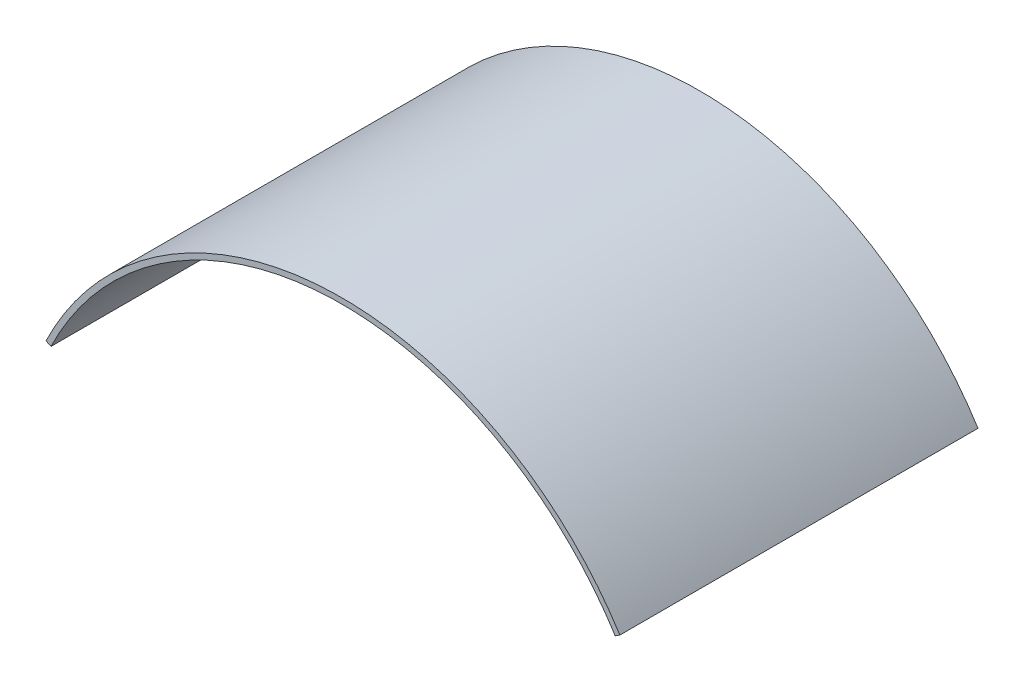
ISO-10303-21;
HEADER;
FILE_DESCRIPTION(('STEP AP214'),'2;1');
FILE_NAME('part.step','',(''),(''),'','','');
FILE_SCHEMA(('AUTOMOTIVE_DESIGN { 1 0 10303 214 1 1 1 1 }'));
ENDSEC;
DATA;
#1=APPLICATION_CONTEXT('core data for automotive mechanical design processes');
#2=APPLICATION_PROTOCOL_DEFINITION('international standard','automotive_design',2000,#1);
#3=PRODUCT_CONTEXT('',#1,'mechanical');
#4=PRODUCT('Part','Part','',(#3));
#5=PRODUCT_RELATED_PRODUCT_CATEGORY('part','',(#4));
#6=PRODUCT_DEFINITION_FORMATION('','',#4);
#7=PRODUCT_DEFINITION_CONTEXT('part definition',#1,'design');
#8=PRODUCT_DEFINITION('design','',#6,#7);
#9=PRODUCT_DEFINITION_SHAPE('','',#8);
#10=(LENGTH_UNIT() NAMED_UNIT(*) SI_UNIT(.MILLI.,.METRE.));
#11=(NAMED_UNIT(*) PLANE_ANGLE_UNIT() SI_UNIT($,.RADIAN.));
#12=(NAMED_UNIT(*) SI_UNIT($,.STERADIAN.) SOLID_ANGLE_UNIT());
#13=UNCERTAINTY_MEASURE_WITH_UNIT(LENGTH_MEASURE(1.E-05),#10,'distance_accuracy_value','');
#14=(GEOMETRIC_REPRESENTATION_CONTEXT(3) GLOBAL_UNCERTAINTY_ASSIGNED_CONTEXT((#13)) GLOBAL_UNIT_ASSIGNED_CONTEXT((#10,
#11,#12)) REPRESENTATION_CONTEXT('',''));
#15=CARTESIAN_POINT('',(0.,0.,0.));
#16=DIRECTION('',(0.,0.,1.));
#17=DIRECTION('',(1.,0.,0.));
#18=AXIS2_PLACEMENT_3D('',#15,#16,#17);
#19=CARTESIAN_POINT('',(93.7608501030228,-45.5138108132375,113.5));
#20=DIRECTION('',(0.,0.,-1.));
#21=DIRECTION('',(-1.,0.,0.));
#22=AXIS2_PLACEMENT_3D('',#19,#20,#21);
#23=CYLINDRICAL_SURFACE('',#22,104.223816792443);
#24=CARTESIAN_POINT('',(93.7608501030228,-45.5138108132375,0.));
#25=DIRECTION('',(0.,0.,1.));
#26=DIRECTION('',(-1.,0.,0.));
#27=AXIS2_PLACEMENT_3D('',#24,#25,#26);
#28=CIRCLE('',#27,104.223816792443);
#29=CARTESIAN_POINT('',(181.865019165655,10.1661620726013,0.));
#30=VERTEX_POINT('',#29);
#31=CARTESIAN_POINT('',(0.,0.,0.));
#32=VERTEX_POINT('',#31);
#33=EDGE_CURVE('E116',#30,#32,#28,.T.);
#34=ORIENTED_EDGE('',*,*,#33,.T.);
#35=DIRECTION('',(0.,0.,-1.));
#36=VECTOR('',#35,1.);
#37=CARTESIAN_POINT('',(0.,0.,113.5));
#38=LINE('',#37,#36);
#39=CARTESIAN_POINT('',(0.,0.,113.5));
#40=VERTEX_POINT('',#39);
#41=EDGE_CURVE('E11',#40,#32,#38,.T.);
#42=ORIENTED_EDGE('',*,*,#41,.F.);
#43=CARTESIAN_POINT('',(93.7608501030228,-45.5138108132375,113.5));
#44=DIRECTION('',(0.,0.,1.));
#45=DIRECTION('',(-1.,0.,0.));
#46=AXIS2_PLACEMENT_3D('',#43,#44,#45);
#47=CIRCLE('',#46,104.223816792443);
#48=CARTESIAN_POINT('',(181.865019165655,10.1661620726013,113.5));
#49=VERTEX_POINT('',#48);
#50=EDGE_CURVE('E98',#49,#40,#47,.T.);
#51=ORIENTED_EDGE('',*,*,#50,.F.);
#52=DIRECTION('',(0.,0.,-1.));
#53=VECTOR('',#52,1.);
#54=CARTESIAN_POINT('',(181.865019165655,10.1661620726013,113.5));
#55=LINE('',#54,#53);
#56=EDGE_CURVE('E112',#49,#30,#55,.T.);
#57=ORIENTED_EDGE('',*,*,#56,.T.);
#58=EDGE_LOOP('',(#34,#42,#51,#57));
#59=FACE_BOUND('',#58,.T.);
#60=ADVANCED_FACE('F38',(#59),#23,.T.);
#61=CARTESIAN_POINT('',(0.,0.,113.5));
#62=DIRECTION('',(0.436692996034443,0.89961059754455,0.));
#63=DIRECTION('',(-0.89961059754455,0.436692996034443,0.));
#64=AXIS2_PLACEMENT_3D('',#61,#62,#63);
#65=PLANE('',#64);
#66=DIRECTION('',(0.89961059754455,-0.436692996034443,0.));
#67=VECTOR('',#66,1.);
#68=CARTESIAN_POINT('',(0.,0.,0.));
#69=LINE('',#68,#67);
#70=CARTESIAN_POINT('',(1.57431854570297,-0.76421274306028,0.));
#71=VERTEX_POINT('',#70);
#72=EDGE_CURVE('E103',#32,#71,#69,.T.);
#73=ORIENTED_EDGE('',*,*,#72,.T.);
#74=DIRECTION('',(0.,0.,-1.));
#75=VECTOR('',#74,1.);
#76=CARTESIAN_POINT('',(1.57431854570297,-0.76421274306028,113.5));
#77=LINE('',#76,#75);
#78=CARTESIAN_POINT('',(1.57431854570297,-0.76421274306028,113.5));
#79=VERTEX_POINT('',#78);
#80=EDGE_CURVE('E47',#79,#71,#77,.T.);
#81=ORIENTED_EDGE('',*,*,#80,.F.);
#82=DIRECTION('',(0.89961059754455,-0.436692996034443,0.));
#83=VECTOR('',#82,1.);
#84=CARTESIAN_POINT('',(0.,0.,113.5));
#85=LINE('',#84,#83);
#86=EDGE_CURVE('E93',#40,#79,#85,.T.);
#87=ORIENTED_EDGE('',*,*,#86,.F.);
#88=ORIENTED_EDGE('',*,*,#41,.T.);
#89=EDGE_LOOP('',(#73,#81,#87,#88));
#90=FACE_BOUND('',#89,.T.);
#91=ADVANCED_FACE('F102',(#90),#65,.F.);
#92=CARTESIAN_POINT('',(93.7608501030228,-45.5138108132375,113.5));
#93=DIRECTION('',(0.,0.,-1.));
#94=DIRECTION('',(-1.,0.,0.));
#95=AXIS2_PLACEMENT_3D('',#92,#93,#94);
#96=CYLINDRICAL_SURFACE('',#95,102.473816792443);
#97=CARTESIAN_POINT('',(93.7608501030228,-45.5138108132375,0.));
#98=DIRECTION('',(0.,0.,-1.));
#99=DIRECTION('',(-1.,0.,0.));
#100=AXIS2_PLACEMENT_3D('',#97,#98,#99);
#101=CIRCLE('',#100,102.473816792443);
#102=CARTESIAN_POINT('',(180.385680751417,9.2312514586073,0.));
#103=VERTEX_POINT('',#102);
#104=EDGE_CURVE('E78',#71,#103,#101,.T.);
#105=ORIENTED_EDGE('',*,*,#104,.T.);
#106=DIRECTION('',(0.,0.,-1.));
#107=VECTOR('',#106,1.);
#108=CARTESIAN_POINT('',(180.385680751417,9.2312514586073,113.5));
#109=LINE('',#108,#107);
#110=CARTESIAN_POINT('',(180.385680751417,9.2312514586073,113.5));
#111=VERTEX_POINT('',#110);
#112=EDGE_CURVE('E105',#111,#103,#109,.T.);
#113=ORIENTED_EDGE('',*,*,#112,.F.);
#114=CARTESIAN_POINT('',(93.7608501030228,-45.5138108132375,113.5));
#115=DIRECTION('',(0.,0.,-1.));
#116=DIRECTION('',(-1.,0.,0.));
#117=AXIS2_PLACEMENT_3D('',#114,#115,#116);
#118=CIRCLE('',#117,102.473816792443);
#119=EDGE_CURVE('E96',#79,#111,#118,.T.);
#120=ORIENTED_EDGE('',*,*,#119,.F.);
#121=ORIENTED_EDGE('',*,*,#80,.T.);
#122=EDGE_LOOP('',(#105,#113,#120,#121));
#123=FACE_BOUND('',#122,.T.);
#124=ADVANCED_FACE('F106',(#123),#96,.F.);
#125=CARTESIAN_POINT('',(181.865019165655,10.1661620726013,113.5));
#126=DIRECTION('',(-0.534234636567982,0.845336236707665,0.));
#127=DIRECTION('',(-0.845336236707665,-0.534234636567982,0.));
#128=AXIS2_PLACEMENT_3D('',#125,#126,#127);
#129=PLANE('',#128);
#130=DIRECTION('',(0.845336236707665,0.534234636567982,0.));
#131=VECTOR('',#130,1.);
#132=CARTESIAN_POINT('',(181.865019165655,10.1661620726013,0.));
#133=LINE('',#132,#131);
#134=EDGE_CURVE('E85',#103,#30,#133,.T.);
#135=ORIENTED_EDGE('',*,*,#134,.T.);
#136=ORIENTED_EDGE('',*,*,#56,.F.);
#137=DIRECTION('',(0.845336236707665,0.534234636567982,0.));
#138=VECTOR('',#137,1.);
#139=CARTESIAN_POINT('',(181.865019165655,10.1661620726013,113.5));
#140=LINE('',#139,#138);
#141=EDGE_CURVE('E58',#111,#49,#140,.T.);
#142=ORIENTED_EDGE('',*,*,#141,.F.);
#143=ORIENTED_EDGE('',*,*,#112,.T.);
#144=EDGE_LOOP('',(#135,#136,#142,#143));
#145=FACE_BOUND('',#144,.T.);
#146=ADVANCED_FACE('F128',(#145),#129,.F.);
#147=CARTESIAN_POINT('',(93.7608501030228,-45.5138108132375,113.5));
#148=DIRECTION('',(0.,0.,-1.));
#149=DIRECTION('',(-1.,0.,0.));
#150=AXIS2_PLACEMENT_3D('',#147,#148,#149);
#151=PLANE('',#150);
#152=ORIENTED_EDGE('',*,*,#50,.T.);
#153=ORIENTED_EDGE('',*,*,#86,.T.);
#154=ORIENTED_EDGE('',*,*,#119,.T.);
#155=ORIENTED_EDGE('',*,*,#141,.T.);
#156=EDGE_LOOP('',(#152,#153,#154,#155));
#157=FACE_BOUND('',#156,.T.);
#158=ADVANCED_FACE('F94',(#157),#151,.F.);
#159=CARTESIAN_POINT('',(93.7608501030228,-45.5138108132375,0.));
#160=DIRECTION('',(0.,0.,-1.));
#161=DIRECTION('',(-1.,0.,0.));
#162=AXIS2_PLACEMENT_3D('',#159,#160,#161);
#163=PLANE('',#162);
#164=ORIENTED_EDGE('',*,*,#33,.F.);
#165=ORIENTED_EDGE('',*,*,#134,.F.);
#166=ORIENTED_EDGE('',*,*,#104,.F.);
#167=ORIENTED_EDGE('',*,*,#72,.F.);
#168=EDGE_LOOP('',(#164,#165,#166,#167));
#169=FACE_BOUND('',#168,.T.);
#170=ADVANCED_FACE('F131',(#169),#163,.T.);
#171=CLOSED_SHELL('',(#60,#91,#124,#146,#158,#170));
#172=MANIFOLD_SOLID_BREP('B2',#171);
#173=ADVANCED_BREP_SHAPE_REPRESENTATION('',(#18,#172),#14);
#174=SHAPE_DEFINITION_REPRESENTATION(#9,#173);
ENDSEC;
END-ISO-10303-21;
